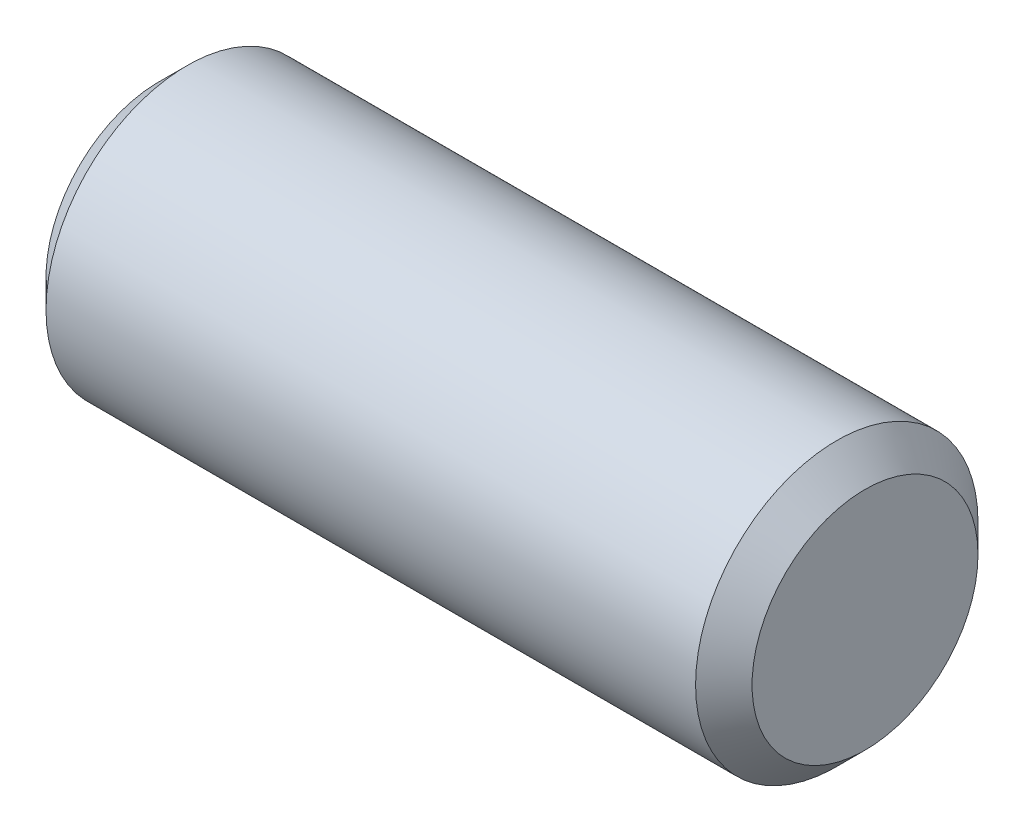
ISO-10303-21;
HEADER;
FILE_DESCRIPTION(('STEP AP214'),'2;1');
FILE_NAME('part.step','',(''),(''),'','','');
FILE_SCHEMA(('AUTOMOTIVE_DESIGN { 1 0 10303 214 1 1 1 1 }'));
ENDSEC;
DATA;
#1=APPLICATION_CONTEXT('core data for automotive mechanical design processes');
#2=APPLICATION_PROTOCOL_DEFINITION('international standard','automotive_design',2000,#1);
#3=PRODUCT_CONTEXT('',#1,'mechanical');
#4=PRODUCT('Part','Part','',(#3));
#5=PRODUCT_RELATED_PRODUCT_CATEGORY('part','',(#4));
#6=PRODUCT_DEFINITION_FORMATION('','',#4);
#7=PRODUCT_DEFINITION_CONTEXT('part definition',#1,'design');
#8=PRODUCT_DEFINITION('design','',#6,#7);
#9=PRODUCT_DEFINITION_SHAPE('','',#8);
#10=(LENGTH_UNIT() NAMED_UNIT(*) SI_UNIT(.MILLI.,.METRE.));
#11=(NAMED_UNIT(*) PLANE_ANGLE_UNIT() SI_UNIT($,.RADIAN.));
#12=(NAMED_UNIT(*) SI_UNIT($,.STERADIAN.) SOLID_ANGLE_UNIT());
#13=UNCERTAINTY_MEASURE_WITH_UNIT(LENGTH_MEASURE(1.E-05),#10,'distance_accuracy_value','');
#14=(GEOMETRIC_REPRESENTATION_CONTEXT(3) GLOBAL_UNCERTAINTY_ASSIGNED_CONTEXT((#13)) GLOBAL_UNIT_ASSIGNED_CONTEXT((#10,
#11,#12)) REPRESENTATION_CONTEXT('',''));
#15=CARTESIAN_POINT('',(0.,0.,0.));
#16=DIRECTION('',(0.,0.,1.));
#17=DIRECTION('',(1.,0.,0.));
#18=AXIS2_PLACEMENT_3D('',#15,#16,#17);
#19=CARTESIAN_POINT('',(-7.9375,0.,0.));
#20=DIRECTION('',(1.,0.,0.));
#21=DIRECTION('',(0.,0.,-1.));
#22=AXIS2_PLACEMENT_3D('',#19,#20,#21);
#23=CYLINDRICAL_SURFACE('',#22,3.175);
#24=CARTESIAN_POINT('',(7.3025,0.,0.));
#25=DIRECTION('',(1.,0.,0.));
#26=DIRECTION('',(0.,0.,-1.));
#27=AXIS2_PLACEMENT_3D('',#24,#25,#26);
#28=CIRCLE('',#27,3.175);
#29=CARTESIAN_POINT('',(7.3025,0.,-3.175));
#30=VERTEX_POINT('',#29);
#31=EDGE_CURVE('E37',#30,#30,#28,.F.);
#32=ORIENTED_EDGE('',*,*,#31,.T.);
#33=EDGE_LOOP('',(#32));
#34=FACE_BOUND('',#33,.T.);
#35=CARTESIAN_POINT('',(-7.3025,0.,0.));
#36=DIRECTION('',(1.,0.,0.));
#37=DIRECTION('',(0.,0.,-1.));
#38=AXIS2_PLACEMENT_3D('',#35,#36,#37);
#39=CIRCLE('',#38,3.175);
#40=CARTESIAN_POINT('',(-7.3025,0.,-3.175));
#41=VERTEX_POINT('',#40);
#42=EDGE_CURVE('E41',#41,#41,#39,.T.);
#43=ORIENTED_EDGE('',*,*,#42,.T.);
#44=EDGE_LOOP('',(#43));
#45=FACE_BOUND('',#44,.T.);
#46=ADVANCED_FACE('F30',(#34,#45),#23,.T.);
#47=CARTESIAN_POINT('',(-7.9375,0.,0.));
#48=DIRECTION('',(1.,0.,0.));
#49=DIRECTION('',(0.,0.,-1.));
#50=AXIS2_PLACEMENT_3D('',#47,#48,#49);
#51=PLANE('',#50);
#52=CARTESIAN_POINT('',(-7.9375,0.,0.));
#53=DIRECTION('',(1.,0.,0.));
#54=DIRECTION('',(0.,0.,-1.));
#55=AXIS2_PLACEMENT_3D('',#52,#53,#54);
#56=CIRCLE('',#55,2.54);
#57=CARTESIAN_POINT('',(-7.9375,0.,-2.54));
#58=VERTEX_POINT('',#57);
#59=EDGE_CURVE('E10',#58,#58,#56,.F.);
#60=ORIENTED_EDGE('',*,*,#59,.T.);
#61=EDGE_LOOP('',(#60));
#62=FACE_BOUND('',#61,.T.);
#63=ADVANCED_FACE('F61',(#62),#51,.F.);
#64=CARTESIAN_POINT('',(7.9375,0.,0.));
#65=DIRECTION('',(1.,0.,0.));
#66=DIRECTION('',(0.,0.,-1.));
#67=AXIS2_PLACEMENT_3D('',#64,#65,#66);
#68=PLANE('',#67);
#69=CARTESIAN_POINT('',(7.9375,0.,0.));
#70=DIRECTION('',(1.,0.,0.));
#71=DIRECTION('',(0.,0.,-1.));
#72=AXIS2_PLACEMENT_3D('',#69,#70,#71);
#73=CIRCLE('',#72,2.54);
#74=CARTESIAN_POINT('',(7.9375,0.,-2.54));
#75=VERTEX_POINT('',#74);
#76=EDGE_CURVE('E45',#75,#75,#73,.T.);
#77=ORIENTED_EDGE('',*,*,#76,.T.);
#78=EDGE_LOOP('',(#77));
#79=FACE_BOUND('',#78,.T.);
#80=ADVANCED_FACE('F51',(#79),#68,.T.);
#81=CARTESIAN_POINT('',(7.9375,0.,0.));
#82=DIRECTION('',(-1.,0.,0.));
#83=DIRECTION('',(0.,0.,1.));
#84=AXIS2_PLACEMENT_3D('',#81,#82,#83);
#85=CONICAL_SURFACE('',#84,2.54,0.785398163397448);
#86=ORIENTED_EDGE('',*,*,#31,.F.);
#87=EDGE_LOOP('',(#86));
#88=FACE_BOUND('',#87,.T.);
#89=ORIENTED_EDGE('',*,*,#76,.F.);
#90=EDGE_LOOP('',(#89));
#91=FACE_BOUND('',#90,.T.);
#92=ADVANCED_FACE('F53',(#88,#91),#85,.T.);
#93=CARTESIAN_POINT('',(-7.3025,0.,0.));
#94=DIRECTION('',(1.,0.,0.));
#95=DIRECTION('',(0.,0.,-1.));
#96=AXIS2_PLACEMENT_3D('',#93,#94,#95);
#97=CONICAL_SURFACE('',#96,3.175,0.785398163397449);
#98=ORIENTED_EDGE('',*,*,#59,.F.);
#99=EDGE_LOOP('',(#98));
#100=FACE_BOUND('',#99,.T.);
#101=ORIENTED_EDGE('',*,*,#42,.F.);
#102=EDGE_LOOP('',(#101));
#103=FACE_BOUND('',#102,.T.);
#104=ADVANCED_FACE('F32',(#100,#103),#97,.T.);
#105=CLOSED_SHELL('',(#46,#63,#80,#92,#104));
#106=MANIFOLD_SOLID_BREP('B2',#105);
#107=ADVANCED_BREP_SHAPE_REPRESENTATION('',(#18,#106),#14);
#108=SHAPE_DEFINITION_REPRESENTATION(#9,#107);
ENDSEC;
END-ISO-10303-21;
